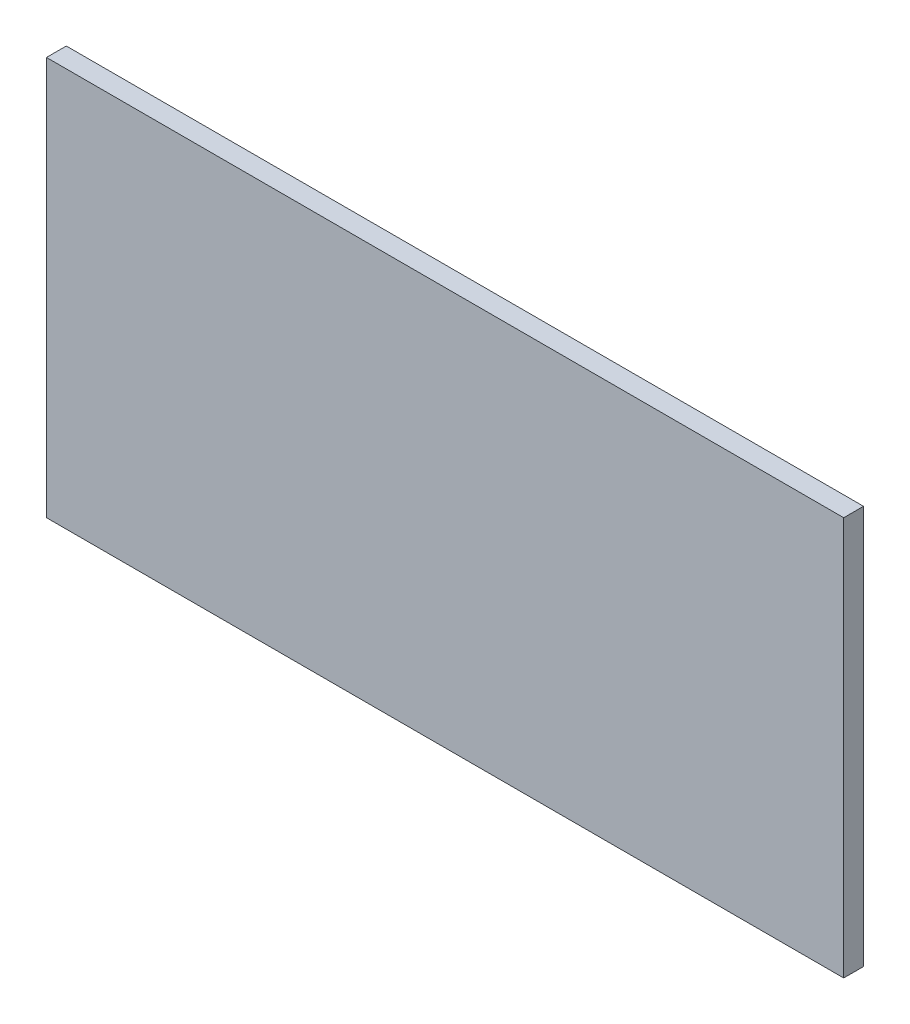
ISO-10303-21;
HEADER;
FILE_DESCRIPTION(('STEP AP214'),'2;1');
FILE_NAME('part.step','',(''),(''),'','','');
FILE_SCHEMA(('AUTOMOTIVE_DESIGN { 1 0 10303 214 1 1 1 1 }'));
ENDSEC;
DATA;
#1=APPLICATION_CONTEXT('core data for automotive mechanical design processes');
#2=APPLICATION_PROTOCOL_DEFINITION('international standard','automotive_design',2000,#1);
#3=PRODUCT_CONTEXT('',#1,'mechanical');
#4=PRODUCT('Part','Part','',(#3));
#5=PRODUCT_RELATED_PRODUCT_CATEGORY('part','',(#4));
#6=PRODUCT_DEFINITION_FORMATION('','',#4);
#7=PRODUCT_DEFINITION_CONTEXT('part definition',#1,'design');
#8=PRODUCT_DEFINITION('design','',#6,#7);
#9=PRODUCT_DEFINITION_SHAPE('','',#8);
#10=(LENGTH_UNIT() NAMED_UNIT(*) SI_UNIT(.MILLI.,.METRE.));
#11=(NAMED_UNIT(*) PLANE_ANGLE_UNIT() SI_UNIT($,.RADIAN.));
#12=(NAMED_UNIT(*) SI_UNIT($,.STERADIAN.) SOLID_ANGLE_UNIT());
#13=UNCERTAINTY_MEASURE_WITH_UNIT(LENGTH_MEASURE(1.E-05),#10,'distance_accuracy_value','');
#14=(GEOMETRIC_REPRESENTATION_CONTEXT(3) GLOBAL_UNCERTAINTY_ASSIGNED_CONTEXT((#13)) GLOBAL_UNIT_ASSIGNED_CONTEXT((#10,
#11,#12)) REPRESENTATION_CONTEXT('',''));
#15=CARTESIAN_POINT('',(0.,0.,0.));
#16=DIRECTION('',(0.,0.,1.));
#17=DIRECTION('',(1.,0.,0.));
#18=AXIS2_PLACEMENT_3D('',#15,#16,#17);
#19=CARTESIAN_POINT('',(90.5,0.,2.25));
#20=DIRECTION('',(0.,-1.,0.));
#21=DIRECTION('',(0.,0.,-1.));
#22=AXIS2_PLACEMENT_3D('',#19,#20,#21);
#23=PLANE('',#22);
#24=DIRECTION('',(-1.,0.,0.));
#25=VECTOR('',#24,1.);
#26=CARTESIAN_POINT('',(90.5,0.,-2.25));
#27=LINE('',#26,#25);
#28=CARTESIAN_POINT('',(90.5,0.,-2.25));
#29=VERTEX_POINT('',#28);
#30=CARTESIAN_POINT('',(-90.5,0.,-2.25));
#31=VERTEX_POINT('',#30);
#32=EDGE_CURVE('E96',#29,#31,#27,.T.);
#33=ORIENTED_EDGE('',*,*,#32,.T.);
#34=DIRECTION('',(0.,0.,-1.));
#35=VECTOR('',#34,1.);
#36=CARTESIAN_POINT('',(-90.5,0.,2.25));
#37=LINE('',#36,#35);
#38=CARTESIAN_POINT('',(-90.5,0.,2.25));
#39=VERTEX_POINT('',#38);
#40=EDGE_CURVE('E11',#39,#31,#37,.T.);
#41=ORIENTED_EDGE('',*,*,#40,.F.);
#42=DIRECTION('',(-1.,0.,0.));
#43=VECTOR('',#42,1.);
#44=CARTESIAN_POINT('',(90.5,0.,2.25));
#45=LINE('',#44,#43);
#46=CARTESIAN_POINT('',(90.5,0.,2.25));
#47=VERTEX_POINT('',#46);
#48=EDGE_CURVE('E84',#47,#39,#45,.T.);
#49=ORIENTED_EDGE('',*,*,#48,.F.);
#50=DIRECTION('',(0.,0.,-1.));
#51=VECTOR('',#50,1.);
#52=CARTESIAN_POINT('',(90.5,0.,2.25));
#53=LINE('',#52,#51);
#54=EDGE_CURVE('E92',#47,#29,#53,.T.);
#55=ORIENTED_EDGE('',*,*,#54,.T.);
#56=EDGE_LOOP('',(#33,#41,#49,#55));
#57=FACE_BOUND('',#56,.T.);
#58=ADVANCED_FACE('F33',(#57),#23,.F.);
#59=CARTESIAN_POINT('',(-90.5,0.,2.25));
#60=DIRECTION('',(1.,0.,0.));
#61=DIRECTION('',(0.,0.,-1.));
#62=AXIS2_PLACEMENT_3D('',#59,#60,#61);
#63=PLANE('',#62);
#64=DIRECTION('',(0.,-1.,0.));
#65=VECTOR('',#64,1.);
#66=CARTESIAN_POINT('',(-90.5,0.,-2.25));
#67=LINE('',#66,#65);
#68=CARTESIAN_POINT('',(-90.5,-90.5,-2.25));
#69=VERTEX_POINT('',#68);
#70=EDGE_CURVE('E88',#31,#69,#67,.T.);
#71=ORIENTED_EDGE('',*,*,#70,.T.);
#72=DIRECTION('',(0.,0.,-1.));
#73=VECTOR('',#72,1.);
#74=CARTESIAN_POINT('',(-90.5,-90.5,2.25));
#75=LINE('',#74,#73);
#76=CARTESIAN_POINT('',(-90.5,-90.5,2.25));
#77=VERTEX_POINT('',#76);
#78=EDGE_CURVE('E41',#77,#69,#75,.T.);
#79=ORIENTED_EDGE('',*,*,#78,.F.);
#80=DIRECTION('',(0.,-1.,0.));
#81=VECTOR('',#80,1.);
#82=CARTESIAN_POINT('',(-90.5,0.,2.25));
#83=LINE('',#82,#81);
#84=EDGE_CURVE('E79',#39,#77,#83,.T.);
#85=ORIENTED_EDGE('',*,*,#84,.F.);
#86=ORIENTED_EDGE('',*,*,#40,.T.);
#87=EDGE_LOOP('',(#71,#79,#85,#86));
#88=FACE_BOUND('',#87,.T.);
#89=ADVANCED_FACE('F87',(#88),#63,.F.);
#90=CARTESIAN_POINT('',(-90.5,-90.5,2.25));
#91=DIRECTION('',(0.,1.,0.));
#92=DIRECTION('',(0.,0.,1.));
#93=AXIS2_PLACEMENT_3D('',#90,#91,#92);
#94=PLANE('',#93);
#95=DIRECTION('',(1.,0.,0.));
#96=VECTOR('',#95,1.);
#97=CARTESIAN_POINT('',(-90.5,-90.5,-2.25));
#98=LINE('',#97,#96);
#99=CARTESIAN_POINT('',(90.5,-90.5,-2.25));
#100=VERTEX_POINT('',#99);
#101=EDGE_CURVE('E66',#69,#100,#98,.T.);
#102=ORIENTED_EDGE('',*,*,#101,.T.);
#103=DIRECTION('',(0.,0.,-1.));
#104=VECTOR('',#103,1.);
#105=CARTESIAN_POINT('',(90.5,-90.5,2.25));
#106=LINE('',#105,#104);
#107=CARTESIAN_POINT('',(90.5,-90.5,2.25));
#108=VERTEX_POINT('',#107);
#109=EDGE_CURVE('E89',#108,#100,#106,.T.);
#110=ORIENTED_EDGE('',*,*,#109,.F.);
#111=DIRECTION('',(1.,0.,0.));
#112=VECTOR('',#111,1.);
#113=CARTESIAN_POINT('',(-90.5,-90.5,2.25));
#114=LINE('',#113,#112);
#115=EDGE_CURVE('E82',#77,#108,#114,.T.);
#116=ORIENTED_EDGE('',*,*,#115,.F.);
#117=ORIENTED_EDGE('',*,*,#78,.T.);
#118=EDGE_LOOP('',(#102,#110,#116,#117));
#119=FACE_BOUND('',#118,.T.);
#120=ADVANCED_FACE('F90',(#119),#94,.F.);
#121=CARTESIAN_POINT('',(90.5,-90.5,2.25));
#122=DIRECTION('',(-1.,0.,0.));
#123=DIRECTION('',(0.,0.,1.));
#124=AXIS2_PLACEMENT_3D('',#121,#122,#123);
#125=PLANE('',#124);
#126=DIRECTION('',(0.,1.,0.));
#127=VECTOR('',#126,1.);
#128=CARTESIAN_POINT('',(90.5,-90.5,-2.25));
#129=LINE('',#128,#127);
#130=EDGE_CURVE('E72',#100,#29,#129,.T.);
#131=ORIENTED_EDGE('',*,*,#130,.T.);
#132=ORIENTED_EDGE('',*,*,#54,.F.);
#133=DIRECTION('',(0.,1.,0.));
#134=VECTOR('',#133,1.);
#135=CARTESIAN_POINT('',(90.5,-90.5,2.25));
#136=LINE('',#135,#134);
#137=EDGE_CURVE('E49',#108,#47,#136,.T.);
#138=ORIENTED_EDGE('',*,*,#137,.F.);
#139=ORIENTED_EDGE('',*,*,#109,.T.);
#140=EDGE_LOOP('',(#131,#132,#138,#139));
#141=FACE_BOUND('',#140,.T.);
#142=ADVANCED_FACE('F103',(#141),#125,.F.);
#143=CARTESIAN_POINT('',(0.,0.,2.25));
#144=DIRECTION('',(0.,0.,1.));
#145=DIRECTION('',(1.,0.,0.));
#146=AXIS2_PLACEMENT_3D('',#143,#144,#145);
#147=PLANE('',#146);
#148=ORIENTED_EDGE('',*,*,#48,.T.);
#149=ORIENTED_EDGE('',*,*,#84,.T.);
#150=ORIENTED_EDGE('',*,*,#115,.T.);
#151=ORIENTED_EDGE('',*,*,#137,.T.);
#152=EDGE_LOOP('',(#148,#149,#150,#151));
#153=FACE_BOUND('',#152,.T.);
#154=ADVANCED_FACE('F80',(#153),#147,.T.);
#155=CARTESIAN_POINT('',(0.,0.,-2.25));
#156=DIRECTION('',(0.,0.,1.));
#157=DIRECTION('',(1.,0.,0.));
#158=AXIS2_PLACEMENT_3D('',#155,#156,#157);
#159=PLANE('',#158);
#160=ORIENTED_EDGE('',*,*,#32,.F.);
#161=ORIENTED_EDGE('',*,*,#130,.F.);
#162=ORIENTED_EDGE('',*,*,#101,.F.);
#163=ORIENTED_EDGE('',*,*,#70,.F.);
#164=EDGE_LOOP('',(#160,#161,#162,#163));
#165=FACE_BOUND('',#164,.T.);
#166=ADVANCED_FACE('F106',(#165),#159,.F.);
#167=CLOSED_SHELL('',(#58,#89,#120,#142,#154,#166));
#168=MANIFOLD_SOLID_BREP('B2',#167);
#169=ADVANCED_BREP_SHAPE_REPRESENTATION('',(#18,#168),#14);
#170=SHAPE_DEFINITION_REPRESENTATION(#9,#169);
ENDSEC;
END-ISO-10303-21;
